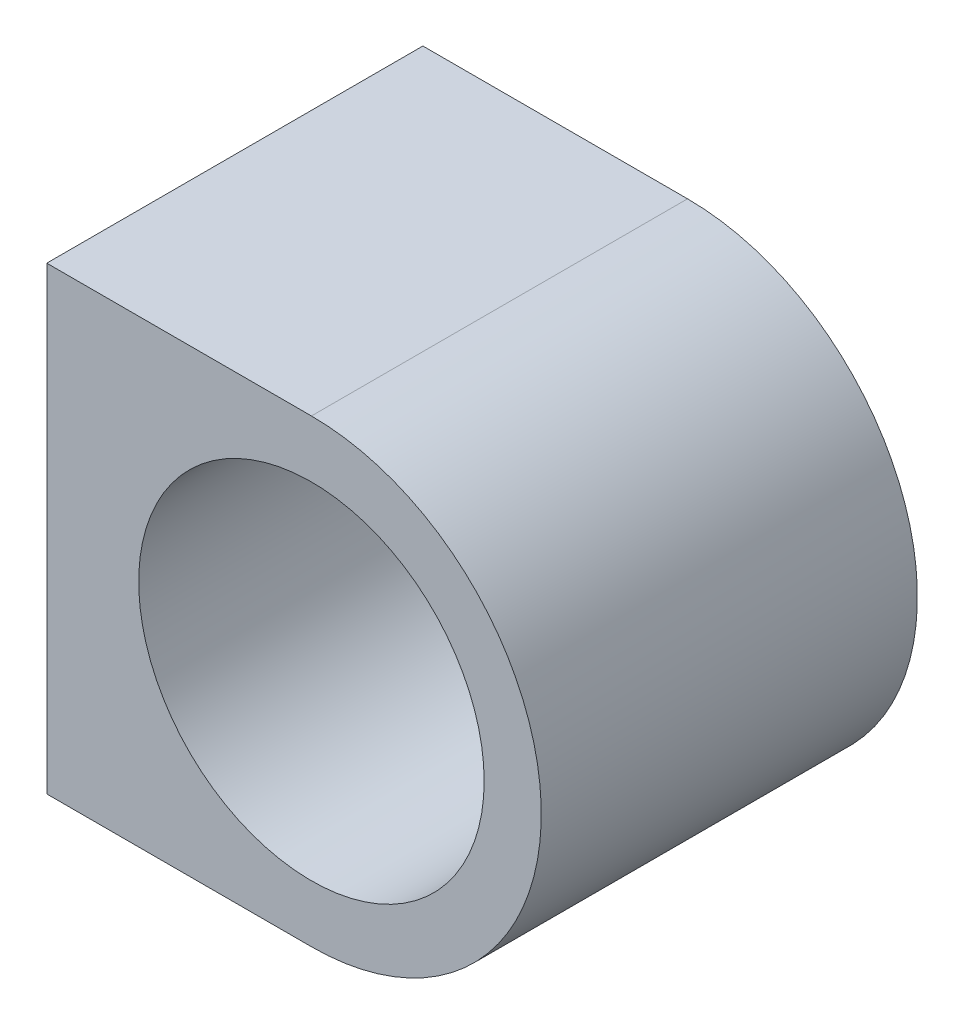
ISO-10303-21;
HEADER;
FILE_DESCRIPTION(('STEP AP214'),'2;1');
FILE_NAME('part.step','',(''),(''),'','','');
FILE_SCHEMA(('AUTOMOTIVE_DESIGN { 1 0 10303 214 1 1 1 1 }'));
ENDSEC;
DATA;
#1=APPLICATION_CONTEXT('core data for automotive mechanical design processes');
#2=APPLICATION_PROTOCOL_DEFINITION('international standard','automotive_design',2000,#1);
#3=PRODUCT_CONTEXT('',#1,'mechanical');
#4=PRODUCT('Part','Part','',(#3));
#5=PRODUCT_RELATED_PRODUCT_CATEGORY('part','',(#4));
#6=PRODUCT_DEFINITION_FORMATION('','',#4);
#7=PRODUCT_DEFINITION_CONTEXT('part definition',#1,'design');
#8=PRODUCT_DEFINITION('design','',#6,#7);
#9=PRODUCT_DEFINITION_SHAPE('','',#8);
#10=(LENGTH_UNIT() NAMED_UNIT(*) SI_UNIT(.MILLI.,.METRE.));
#11=(NAMED_UNIT(*) PLANE_ANGLE_UNIT() SI_UNIT($,.RADIAN.));
#12=(NAMED_UNIT(*) SI_UNIT($,.STERADIAN.) SOLID_ANGLE_UNIT());
#13=UNCERTAINTY_MEASURE_WITH_UNIT(LENGTH_MEASURE(1.E-05),#10,'distance_accuracy_value','');
#14=(GEOMETRIC_REPRESENTATION_CONTEXT(3) GLOBAL_UNCERTAINTY_ASSIGNED_CONTEXT((#13)) GLOBAL_UNIT_ASSIGNED_CONTEXT((#10,
#11,#12)) REPRESENTATION_CONTEXT('',''));
#15=CARTESIAN_POINT('',(0.,0.,0.));
#16=DIRECTION('',(0.,0.,1.));
#17=DIRECTION('',(1.,0.,0.));
#18=AXIS2_PLACEMENT_3D('',#15,#16,#17);
#19=CARTESIAN_POINT('',(0.,0.,13.5));
#20=DIRECTION('',(0.,0.,1.));
#21=DIRECTION('',(1.,0.,0.));
#22=AXIS2_PLACEMENT_3D('',#19,#20,#21);
#23=PLANE('',#22);
#24=CARTESIAN_POINT('',(0.,0.,13.5));
#25=DIRECTION('',(0.,0.,1.));
#26=DIRECTION('',(1.,0.,0.));
#27=AXIS2_PLACEMENT_3D('',#24,#25,#26);
#28=CIRCLE('',#27,8.25);
#29=CARTESIAN_POINT('',(0.,-8.25,13.5));
#30=VERTEX_POINT('',#29);
#31=CARTESIAN_POINT('',(0.,8.25,13.5));
#32=VERTEX_POINT('',#31);
#33=EDGE_CURVE('E134',#30,#32,#28,.T.);
#34=ORIENTED_EDGE('',*,*,#33,.T.);
#35=DIRECTION('',(-1.,0.,0.));
#36=VECTOR('',#35,1.);
#37=CARTESIAN_POINT('',(0.,8.25,13.5));
#38=LINE('',#37,#36);
#39=CARTESIAN_POINT('',(-9.5,8.25,13.5));
#40=VERTEX_POINT('',#39);
#41=EDGE_CURVE('E81',#32,#40,#38,.T.);
#42=ORIENTED_EDGE('',*,*,#41,.T.);
#43=DIRECTION('',(0.,-1.,0.));
#44=VECTOR('',#43,1.);
#45=CARTESIAN_POINT('',(-9.5,8.25,13.5));
#46=LINE('',#45,#44);
#47=CARTESIAN_POINT('',(-9.5,-8.25,13.5));
#48=VERTEX_POINT('',#47);
#49=EDGE_CURVE('E137',#40,#48,#46,.T.);
#50=ORIENTED_EDGE('',*,*,#49,.T.);
#51=DIRECTION('',(1.,0.,0.));
#52=VECTOR('',#51,1.);
#53=CARTESIAN_POINT('',(0.,-8.25,13.5));
#54=LINE('',#53,#52);
#55=EDGE_CURVE('E50',#48,#30,#54,.T.);
#56=ORIENTED_EDGE('',*,*,#55,.T.);
#57=EDGE_LOOP('',(#34,#42,#50,#56));
#58=FACE_BOUND('',#57,.T.);
#59=CARTESIAN_POINT('',(0.,0.,13.5));
#60=DIRECTION('',(0.,0.,1.));
#61=DIRECTION('',(1.,0.,0.));
#62=AXIS2_PLACEMENT_3D('',#59,#60,#61);
#63=CIRCLE('',#62,6.2);
#64=CARTESIAN_POINT('',(6.2,0.,13.5));
#65=VERTEX_POINT('',#64);
#66=EDGE_CURVE('E128',#65,#65,#63,.T.);
#67=ORIENTED_EDGE('',*,*,#66,.F.);
#68=EDGE_LOOP('',(#67));
#69=FACE_BOUND('',#68,.T.);
#70=ADVANCED_FACE('F33',(#58,#69),#23,.T.);
#71=CARTESIAN_POINT('',(0.,0.,0.));
#72=DIRECTION('',(0.,0.,1.));
#73=DIRECTION('',(1.,0.,0.));
#74=AXIS2_PLACEMENT_3D('',#71,#72,#73);
#75=PLANE('',#74);
#76=CARTESIAN_POINT('',(0.,0.,0.));
#77=DIRECTION('',(0.,0.,1.));
#78=DIRECTION('',(1.,0.,0.));
#79=AXIS2_PLACEMENT_3D('',#76,#77,#78);
#80=CIRCLE('',#79,8.25);
#81=CARTESIAN_POINT('',(0.,-8.25,0.));
#82=VERTEX_POINT('',#81);
#83=CARTESIAN_POINT('',(0.,8.25,0.));
#84=VERTEX_POINT('',#83);
#85=EDGE_CURVE('E131',#82,#84,#80,.T.);
#86=ORIENTED_EDGE('',*,*,#85,.F.);
#87=DIRECTION('',(1.,0.,0.));
#88=VECTOR('',#87,1.);
#89=CARTESIAN_POINT('',(0.,-8.25,0.));
#90=LINE('',#89,#88);
#91=CARTESIAN_POINT('',(-9.5,-8.25,0.));
#92=VERTEX_POINT('',#91);
#93=EDGE_CURVE('E74',#92,#82,#90,.T.);
#94=ORIENTED_EDGE('',*,*,#93,.F.);
#95=DIRECTION('',(0.,-1.,0.));
#96=VECTOR('',#95,1.);
#97=CARTESIAN_POINT('',(-9.5,8.25,0.));
#98=LINE('',#97,#96);
#99=CARTESIAN_POINT('',(-9.5,8.25,0.));
#100=VERTEX_POINT('',#99);
#101=EDGE_CURVE('E68',#100,#92,#98,.T.);
#102=ORIENTED_EDGE('',*,*,#101,.F.);
#103=DIRECTION('',(-1.,0.,0.));
#104=VECTOR('',#103,1.);
#105=CARTESIAN_POINT('',(0.,8.25,0.));
#106=LINE('',#105,#104);
#107=EDGE_CURVE('E143',#84,#100,#106,.T.);
#108=ORIENTED_EDGE('',*,*,#107,.F.);
#109=EDGE_LOOP('',(#86,#94,#102,#108));
#110=FACE_BOUND('',#109,.T.);
#111=CARTESIAN_POINT('',(0.,0.,0.));
#112=DIRECTION('',(0.,0.,1.));
#113=DIRECTION('',(1.,0.,0.));
#114=AXIS2_PLACEMENT_3D('',#111,#112,#113);
#115=CIRCLE('',#114,6.2);
#116=CARTESIAN_POINT('',(6.2,0.,0.));
#117=VERTEX_POINT('',#116);
#118=EDGE_CURVE('E127',#117,#117,#115,.T.);
#119=ORIENTED_EDGE('',*,*,#118,.T.);
#120=EDGE_LOOP('',(#119));
#121=FACE_BOUND('',#120,.T.);
#122=ADVANCED_FACE('F153',(#110,#121),#75,.F.);
#123=CARTESIAN_POINT('',(0.,0.,13.5));
#124=DIRECTION('',(0.,0.,-1.));
#125=DIRECTION('',(-1.,0.,0.));
#126=AXIS2_PLACEMENT_3D('',#123,#124,#125);
#127=CYLINDRICAL_SURFACE('',#126,8.25);
#128=ORIENTED_EDGE('',*,*,#85,.T.);
#129=DIRECTION('',(0.,0.,-1.));
#130=VECTOR('',#129,1.);
#131=CARTESIAN_POINT('',(0.,8.25,13.5));
#132=LINE('',#131,#130);
#133=EDGE_CURVE('E11',#32,#84,#132,.T.);
#134=ORIENTED_EDGE('',*,*,#133,.F.);
#135=ORIENTED_EDGE('',*,*,#33,.F.);
#136=DIRECTION('',(0.,0.,-1.));
#137=VECTOR('',#136,1.);
#138=CARTESIAN_POINT('',(0.,-8.25,13.5));
#139=LINE('',#138,#137);
#140=EDGE_CURVE('E140',#30,#82,#139,.T.);
#141=ORIENTED_EDGE('',*,*,#140,.T.);
#142=EDGE_LOOP('',(#128,#134,#135,#141));
#143=FACE_BOUND('',#142,.T.);
#144=ADVANCED_FACE('F35',(#143),#127,.T.);
#145=CARTESIAN_POINT('',(0.,8.25,13.5));
#146=DIRECTION('',(0.,-1.,0.));
#147=DIRECTION('',(1.,0.,0.));
#148=AXIS2_PLACEMENT_3D('',#145,#146,#147);
#149=PLANE('',#148);
#150=ORIENTED_EDGE('',*,*,#107,.T.);
#151=DIRECTION('',(0.,0.,-1.));
#152=VECTOR('',#151,1.);
#153=CARTESIAN_POINT('',(-9.5,8.25,13.5));
#154=LINE('',#153,#152);
#155=EDGE_CURVE('E42',#40,#100,#154,.T.);
#156=ORIENTED_EDGE('',*,*,#155,.F.);
#157=ORIENTED_EDGE('',*,*,#41,.F.);
#158=ORIENTED_EDGE('',*,*,#133,.T.);
#159=EDGE_LOOP('',(#150,#156,#157,#158));
#160=FACE_BOUND('',#159,.T.);
#161=ADVANCED_FACE('F169',(#160),#149,.F.);
#162=CARTESIAN_POINT('',(-9.5,8.25,13.5));
#163=DIRECTION('',(1.,0.,0.));
#164=DIRECTION('',(0.,0.,-1.));
#165=AXIS2_PLACEMENT_3D('',#162,#163,#164);
#166=PLANE('',#165);
#167=CARTESIAN_POINT('',(-9.5,-5.,2.5));
#168=DIRECTION('',(-1.,0.,0.));
#169=DIRECTION('',(0.,0.,1.));
#170=AXIS2_PLACEMENT_3D('',#167,#168,#169);
#171=CIRCLE('',#170,1.35);
#172=CARTESIAN_POINT('',(-9.5,-5.,3.85));
#173=VERTEX_POINT('',#172);
#174=EDGE_CURVE('E105',#173,#173,#171,.T.);
#175=ORIENTED_EDGE('',*,*,#174,.F.);
#176=EDGE_LOOP('',(#175));
#177=FACE_BOUND('',#176,.T.);
#178=CARTESIAN_POINT('',(-9.5,5.,2.5));
#179=DIRECTION('',(-1.,0.,0.));
#180=DIRECTION('',(0.,0.,1.));
#181=AXIS2_PLACEMENT_3D('',#178,#179,#180);
#182=CIRCLE('',#181,1.35);
#183=CARTESIAN_POINT('',(-9.5,5.,3.85));
#184=VERTEX_POINT('',#183);
#185=EDGE_CURVE('E104',#184,#184,#182,.T.);
#186=ORIENTED_EDGE('',*,*,#185,.F.);
#187=EDGE_LOOP('',(#186));
#188=FACE_BOUND('',#187,.T.);
#189=CARTESIAN_POINT('',(-9.5,5.,11.));
#190=DIRECTION('',(-1.,0.,0.));
#191=DIRECTION('',(0.,0.,1.));
#192=AXIS2_PLACEMENT_3D('',#189,#190,#191);
#193=CIRCLE('',#192,1.35);
#194=CARTESIAN_POINT('',(-9.5,5.,12.35));
#195=VERTEX_POINT('',#194);
#196=EDGE_CURVE('E115',#195,#195,#193,.T.);
#197=ORIENTED_EDGE('',*,*,#196,.F.);
#198=EDGE_LOOP('',(#197));
#199=FACE_BOUND('',#198,.T.);
#200=CARTESIAN_POINT('',(-9.5,-5.,11.));
#201=DIRECTION('',(-1.,0.,0.));
#202=DIRECTION('',(0.,0.,1.));
#203=AXIS2_PLACEMENT_3D('',#200,#201,#202);
#204=CIRCLE('',#203,1.35);
#205=CARTESIAN_POINT('',(-9.5,-5.,12.35));
#206=VERTEX_POINT('',#205);
#207=EDGE_CURVE('E121',#206,#206,#204,.T.);
#208=ORIENTED_EDGE('',*,*,#207,.F.);
#209=EDGE_LOOP('',(#208));
#210=FACE_BOUND('',#209,.T.);
#211=ORIENTED_EDGE('',*,*,#101,.T.);
#212=DIRECTION('',(0.,0.,-1.));
#213=VECTOR('',#212,1.);
#214=CARTESIAN_POINT('',(-9.5,-8.25,13.5));
#215=LINE('',#214,#213);
#216=EDGE_CURVE('E148',#48,#92,#215,.T.);
#217=ORIENTED_EDGE('',*,*,#216,.F.);
#218=ORIENTED_EDGE('',*,*,#49,.F.);
#219=ORIENTED_EDGE('',*,*,#155,.T.);
#220=EDGE_LOOP('',(#211,#217,#218,#219));
#221=FACE_BOUND('',#220,.T.);
#222=ADVANCED_FACE('F150',(#177,#188,#199,#210,#221),#166,.F.);
#223=CARTESIAN_POINT('',(0.,-8.25,13.5));
#224=DIRECTION('',(0.,1.,0.));
#225=DIRECTION('',(-1.,0.,0.));
#226=AXIS2_PLACEMENT_3D('',#223,#224,#225);
#227=PLANE('',#226);
#228=ORIENTED_EDGE('',*,*,#93,.T.);
#229=ORIENTED_EDGE('',*,*,#140,.F.);
#230=ORIENTED_EDGE('',*,*,#55,.F.);
#231=ORIENTED_EDGE('',*,*,#216,.T.);
#232=EDGE_LOOP('',(#228,#229,#230,#231));
#233=FACE_BOUND('',#232,.T.);
#234=ADVANCED_FACE('F158',(#233),#227,.F.);
#235=CARTESIAN_POINT('',(0.,0.,13.5));
#236=DIRECTION('',(0.,0.,-1.));
#237=DIRECTION('',(-1.,0.,0.));
#238=AXIS2_PLACEMENT_3D('',#235,#236,#237);
#239=CYLINDRICAL_SURFACE('',#238,6.2);
#240=ORIENTED_EDGE('',*,*,#66,.T.);
#241=EDGE_LOOP('',(#240));
#242=FACE_BOUND('',#241,.T.);
#243=ORIENTED_EDGE('',*,*,#118,.F.);
#244=EDGE_LOOP('',(#243));
#245=FACE_BOUND('',#244,.T.);
#246=ADVANCED_FACE('F160',(#242,#245),#239,.F.);
#247=CARTESIAN_POINT('',(-5.5,-5.,11.));
#248=DIRECTION('',(-1.,0.,0.));
#249=DIRECTION('',(0.,0.,1.));
#250=AXIS2_PLACEMENT_3D('',#247,#248,#249);
#251=CONICAL_SURFACE('',#250,1.35,1.02974425867665);
#252=CARTESIAN_POINT('',(-4.68883816431279,-5.,11.));
#253=VERTEX_POINT('',#252);
#254=VERTEX_LOOP('',#253);
#255=FACE_BOUND('',#254,.T.);
#256=CARTESIAN_POINT('',(-5.5,-5.,11.));
#257=DIRECTION('',(-1.,0.,0.));
#258=DIRECTION('',(0.,0.,1.));
#259=AXIS2_PLACEMENT_3D('',#256,#257,#258);
#260=CIRCLE('',#259,1.35);
#261=CARTESIAN_POINT('',(-5.5,-5.,12.35));
#262=VERTEX_POINT('',#261);
#263=EDGE_CURVE('E124',#262,#262,#260,.T.);
#264=ORIENTED_EDGE('',*,*,#263,.T.);
#265=EDGE_LOOP('',(#264));
#266=FACE_BOUND('',#265,.T.);
#267=ADVANCED_FACE('F166',(#255,#266),#251,.F.);
#268=CARTESIAN_POINT('',(-9.5,-5.,11.));
#269=DIRECTION('',(-1.,0.,0.));
#270=DIRECTION('',(0.,0.,1.));
#271=AXIS2_PLACEMENT_3D('',#268,#269,#270);
#272=CYLINDRICAL_SURFACE('',#271,1.35);
#273=ORIENTED_EDGE('',*,*,#263,.F.);
#274=EDGE_LOOP('',(#273));
#275=FACE_BOUND('',#274,.T.);
#276=ORIENTED_EDGE('',*,*,#207,.T.);
#277=EDGE_LOOP('',(#276));
#278=FACE_BOUND('',#277,.T.);
#279=ADVANCED_FACE('F182',(#275,#278),#272,.F.);
#280=CARTESIAN_POINT('',(-5.5,5.,11.));
#281=DIRECTION('',(-1.,0.,0.));
#282=DIRECTION('',(0.,0.,1.));
#283=AXIS2_PLACEMENT_3D('',#280,#281,#282);
#284=CONICAL_SURFACE('',#283,1.35,1.02974425867665);
#285=CARTESIAN_POINT('',(-4.68883816431279,5.,11.));
#286=VERTEX_POINT('',#285);
#287=VERTEX_LOOP('',#286);
#288=FACE_BOUND('',#287,.T.);
#289=CARTESIAN_POINT('',(-5.5,5.,11.));
#290=DIRECTION('',(-1.,0.,0.));
#291=DIRECTION('',(0.,0.,1.));
#292=AXIS2_PLACEMENT_3D('',#289,#290,#291);
#293=CIRCLE('',#292,1.35);
#294=CARTESIAN_POINT('',(-5.5,5.,12.35));
#295=VERTEX_POINT('',#294);
#296=EDGE_CURVE('E118',#295,#295,#293,.T.);
#297=ORIENTED_EDGE('',*,*,#296,.T.);
#298=EDGE_LOOP('',(#297));
#299=FACE_BOUND('',#298,.T.);
#300=ADVANCED_FACE('F186',(#288,#299),#284,.F.);
#301=CARTESIAN_POINT('',(-9.5,5.,11.));
#302=DIRECTION('',(-1.,0.,0.));
#303=DIRECTION('',(0.,0.,1.));
#304=AXIS2_PLACEMENT_3D('',#301,#302,#303);
#305=CYLINDRICAL_SURFACE('',#304,1.35);
#306=ORIENTED_EDGE('',*,*,#296,.F.);
#307=EDGE_LOOP('',(#306));
#308=FACE_BOUND('',#307,.T.);
#309=ORIENTED_EDGE('',*,*,#196,.T.);
#310=EDGE_LOOP('',(#309));
#311=FACE_BOUND('',#310,.T.);
#312=ADVANCED_FACE('F190',(#308,#311),#305,.F.);
#313=CARTESIAN_POINT('',(-5.5,5.,2.5));
#314=DIRECTION('',(-1.,0.,0.));
#315=DIRECTION('',(0.,0.,1.));
#316=AXIS2_PLACEMENT_3D('',#313,#314,#315);
#317=CONICAL_SURFACE('',#316,1.35,1.02974425867665);
#318=CARTESIAN_POINT('',(-4.68883816431279,5.,2.5));
#319=VERTEX_POINT('',#318);
#320=VERTEX_LOOP('',#319);
#321=FACE_BOUND('',#320,.T.);
#322=CARTESIAN_POINT('',(-5.5,5.,2.5));
#323=DIRECTION('',(-1.,0.,0.));
#324=DIRECTION('',(0.,0.,1.));
#325=AXIS2_PLACEMENT_3D('',#322,#323,#324);
#326=CIRCLE('',#325,1.35);
#327=CARTESIAN_POINT('',(-5.5,5.,3.85));
#328=VERTEX_POINT('',#327);
#329=EDGE_CURVE('E108',#328,#328,#326,.T.);
#330=ORIENTED_EDGE('',*,*,#329,.T.);
#331=EDGE_LOOP('',(#330));
#332=FACE_BOUND('',#331,.T.);
#333=ADVANCED_FACE('F194',(#321,#332),#317,.F.);
#334=CARTESIAN_POINT('',(-9.5,5.,2.5));
#335=DIRECTION('',(-1.,0.,0.));
#336=DIRECTION('',(0.,0.,1.));
#337=AXIS2_PLACEMENT_3D('',#334,#335,#336);
#338=CYLINDRICAL_SURFACE('',#337,1.35);
#339=ORIENTED_EDGE('',*,*,#329,.F.);
#340=EDGE_LOOP('',(#339));
#341=FACE_BOUND('',#340,.T.);
#342=ORIENTED_EDGE('',*,*,#185,.T.);
#343=EDGE_LOOP('',(#342));
#344=FACE_BOUND('',#343,.T.);
#345=ADVANCED_FACE('F98',(#341,#344),#338,.F.);
#346=CARTESIAN_POINT('',(-5.5,-5.,2.5));
#347=DIRECTION('',(-1.,0.,0.));
#348=DIRECTION('',(0.,0.,1.));
#349=AXIS2_PLACEMENT_3D('',#346,#347,#348);
#350=CONICAL_SURFACE('',#349,1.35,1.02974425867665);
#351=CARTESIAN_POINT('',(-4.68883816431279,-5.,2.5));
#352=VERTEX_POINT('',#351);
#353=VERTEX_LOOP('',#352);
#354=FACE_BOUND('',#353,.T.);
#355=CARTESIAN_POINT('',(-5.5,-5.,2.5));
#356=DIRECTION('',(-1.,0.,0.));
#357=DIRECTION('',(0.,0.,1.));
#358=AXIS2_PLACEMENT_3D('',#355,#356,#357);
#359=CIRCLE('',#358,1.35);
#360=CARTESIAN_POINT('',(-5.5,-5.,3.85));
#361=VERTEX_POINT('',#360);
#362=EDGE_CURVE('E102',#361,#361,#359,.T.);
#363=ORIENTED_EDGE('',*,*,#362,.T.);
#364=EDGE_LOOP('',(#363));
#365=FACE_BOUND('',#364,.T.);
#366=ADVANCED_FACE('F94',(#354,#365),#350,.F.);
#367=CARTESIAN_POINT('',(-9.5,-5.,2.5));
#368=DIRECTION('',(-1.,0.,0.));
#369=DIRECTION('',(0.,0.,1.));
#370=AXIS2_PLACEMENT_3D('',#367,#368,#369);
#371=CYLINDRICAL_SURFACE('',#370,1.35);
#372=ORIENTED_EDGE('',*,*,#362,.F.);
#373=EDGE_LOOP('',(#372));
#374=FACE_BOUND('',#373,.T.);
#375=ORIENTED_EDGE('',*,*,#174,.T.);
#376=EDGE_LOOP('',(#375));
#377=FACE_BOUND('',#376,.T.);
#378=ADVANCED_FACE('F97',(#374,#377),#371,.F.);
#379=CLOSED_SHELL('',(#70,#122,#144,#161,#222,#234,#246,#267,#279,#300,#312,#333,#345,#366,#378));
#380=MANIFOLD_SOLID_BREP('B2',#379);
#381=ADVANCED_BREP_SHAPE_REPRESENTATION('',(#18,#380),#14);
#382=SHAPE_DEFINITION_REPRESENTATION(#9,#381);
ENDSEC;
END-ISO-10303-21;
